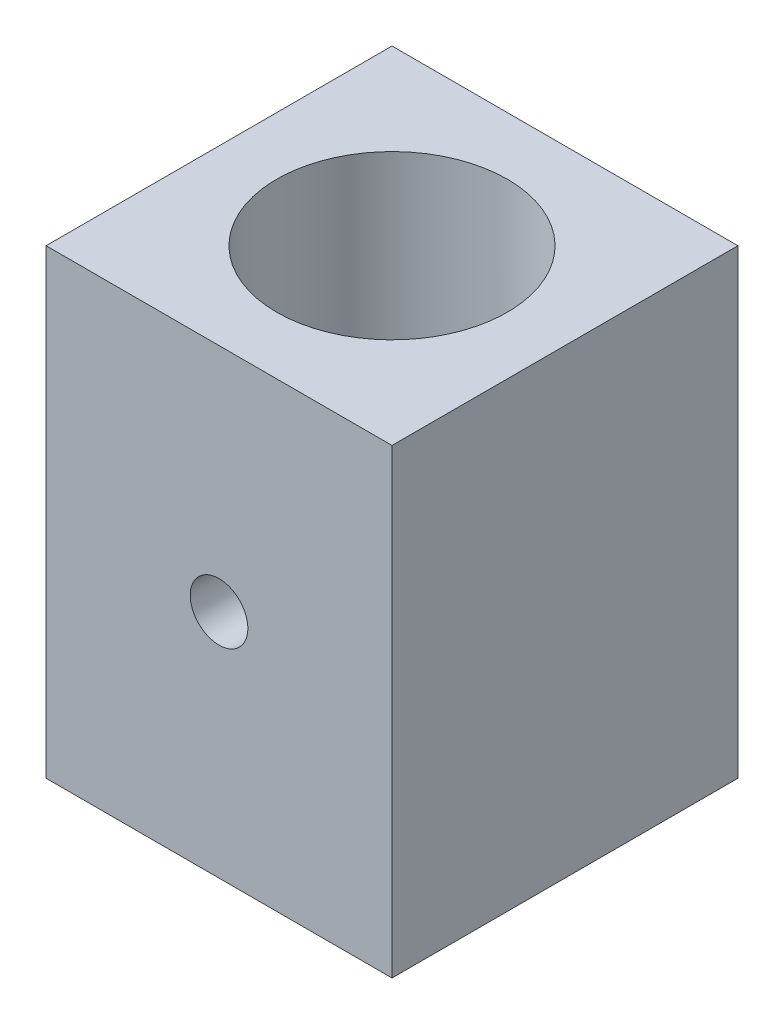
ISO-10303-21;
HEADER;
FILE_DESCRIPTION(('STEP AP214'),'2;1');
FILE_NAME('part.step','',(''),(''),'','','');
FILE_SCHEMA(('AUTOMOTIVE_DESIGN { 1 0 10303 214 1 1 1 1 }'));
ENDSEC;
DATA;
#1=APPLICATION_CONTEXT('core data for automotive mechanical design processes');
#2=APPLICATION_PROTOCOL_DEFINITION('international standard','automotive_design',2000,#1);
#3=PRODUCT_CONTEXT('',#1,'mechanical');
#4=PRODUCT('Part','Part','',(#3));
#5=PRODUCT_RELATED_PRODUCT_CATEGORY('part','',(#4));
#6=PRODUCT_DEFINITION_FORMATION('','',#4);
#7=PRODUCT_DEFINITION_CONTEXT('part definition',#1,'design');
#8=PRODUCT_DEFINITION('design','',#6,#7);
#9=PRODUCT_DEFINITION_SHAPE('','',#8);
#10=(LENGTH_UNIT() NAMED_UNIT(*) SI_UNIT(.MILLI.,.METRE.));
#11=(NAMED_UNIT(*) PLANE_ANGLE_UNIT() SI_UNIT($,.RADIAN.));
#12=(NAMED_UNIT(*) SI_UNIT($,.STERADIAN.) SOLID_ANGLE_UNIT());
#13=UNCERTAINTY_MEASURE_WITH_UNIT(LENGTH_MEASURE(1.E-05),#10,'distance_accuracy_value','');
#14=(GEOMETRIC_REPRESENTATION_CONTEXT(3) GLOBAL_UNCERTAINTY_ASSIGNED_CONTEXT((#13)) GLOBAL_UNIT_ASSIGNED_CONTEXT((#10,
#11,#12)) REPRESENTATION_CONTEXT('',''));
#15=CARTESIAN_POINT('',(0.,0.,0.));
#16=DIRECTION('',(0.,0.,1.));
#17=DIRECTION('',(1.,0.,0.));
#18=AXIS2_PLACEMENT_3D('',#15,#16,#17);
#19=CARTESIAN_POINT('',(0.,101.6,0.));
#20=DIRECTION('',(1.,0.,0.));
#21=DIRECTION('',(0.,0.,-1.));
#22=AXIS2_PLACEMENT_3D('',#19,#20,#21);
#23=PLANE('',#22);
#24=DIRECTION('',(0.,0.,1.));
#25=VECTOR('',#24,1.);
#26=CARTESIAN_POINT('',(0.,0.,0.));
#27=LINE('',#26,#25);
#28=CARTESIAN_POINT('',(0.,0.,-76.2));
#29=VERTEX_POINT('',#28);
#30=CARTESIAN_POINT('',(0.,0.,0.));
#31=VERTEX_POINT('',#30);
#32=EDGE_CURVE('E103',#29,#31,#27,.T.);
#33=ORIENTED_EDGE('',*,*,#32,.T.);
#34=DIRECTION('',(0.,-1.,0.));
#35=VECTOR('',#34,1.);
#36=CARTESIAN_POINT('',(0.,101.6,0.));
#37=LINE('',#36,#35);
#38=CARTESIAN_POINT('',(0.,101.6,0.));
#39=VERTEX_POINT('',#38);
#40=EDGE_CURVE('E11',#39,#31,#37,.T.);
#41=ORIENTED_EDGE('',*,*,#40,.F.);
#42=DIRECTION('',(0.,0.,1.));
#43=VECTOR('',#42,1.);
#44=CARTESIAN_POINT('',(0.,101.6,0.));
#45=LINE('',#44,#43);
#46=CARTESIAN_POINT('',(0.,101.6,-76.2));
#47=VERTEX_POINT('',#46);
#48=EDGE_CURVE('E90',#47,#39,#45,.T.);
#49=ORIENTED_EDGE('',*,*,#48,.F.);
#50=DIRECTION('',(0.,-1.,0.));
#51=VECTOR('',#50,1.);
#52=CARTESIAN_POINT('',(0.,101.6,-76.2));
#53=LINE('',#52,#51);
#54=EDGE_CURVE('E99',#47,#29,#53,.T.);
#55=ORIENTED_EDGE('',*,*,#54,.T.);
#56=EDGE_LOOP('',(#33,#41,#49,#55));
#57=FACE_BOUND('',#56,.T.);
#58=ADVANCED_FACE('F33',(#57),#23,.F.);
#59=CARTESIAN_POINT('',(0.,101.6,0.));
#60=DIRECTION('',(0.,0.,-1.));
#61=DIRECTION('',(-1.,0.,0.));
#62=AXIS2_PLACEMENT_3D('',#59,#60,#61);
#63=PLANE('',#62);
#64=CARTESIAN_POINT('',(38.1,50.8,0.));
#65=DIRECTION('',(0.,0.,1.));
#66=DIRECTION('',(1.,0.,0.));
#67=AXIS2_PLACEMENT_3D('',#64,#65,#66);
#68=CIRCLE('',#67,6.35);
#69=CARTESIAN_POINT('',(44.45,50.8,0.));
#70=VERTEX_POINT('',#69);
#71=EDGE_CURVE('E106',#70,#70,#68,.T.);
#72=ORIENTED_EDGE('',*,*,#71,.F.);
#73=EDGE_LOOP('',(#72));
#74=FACE_BOUND('',#73,.T.);
#75=DIRECTION('',(1.,0.,0.));
#76=VECTOR('',#75,1.);
#77=CARTESIAN_POINT('',(0.,0.,0.));
#78=LINE('',#77,#76);
#79=CARTESIAN_POINT('',(76.2,0.,0.));
#80=VERTEX_POINT('',#79);
#81=EDGE_CURVE('E94',#31,#80,#78,.T.);
#82=ORIENTED_EDGE('',*,*,#81,.T.);
#83=DIRECTION('',(0.,-1.,0.));
#84=VECTOR('',#83,1.);
#85=CARTESIAN_POINT('',(76.2,101.6,0.));
#86=LINE('',#85,#84);
#87=CARTESIAN_POINT('',(76.2,101.6,0.));
#88=VERTEX_POINT('',#87);
#89=EDGE_CURVE('E46',#88,#80,#86,.T.);
#90=ORIENTED_EDGE('',*,*,#89,.F.);
#91=DIRECTION('',(1.,0.,0.));
#92=VECTOR('',#91,1.);
#93=CARTESIAN_POINT('',(0.,101.6,0.));
#94=LINE('',#93,#92);
#95=EDGE_CURVE('E85',#39,#88,#94,.T.);
#96=ORIENTED_EDGE('',*,*,#95,.F.);
#97=ORIENTED_EDGE('',*,*,#40,.T.);
#98=EDGE_LOOP('',(#82,#90,#96,#97));
#99=FACE_BOUND('',#98,.T.);
#100=ADVANCED_FACE('F93',(#74,#99),#63,.F.);
#101=CARTESIAN_POINT('',(76.2,101.6,0.));
#102=DIRECTION('',(-1.,0.,0.));
#103=DIRECTION('',(0.,0.,1.));
#104=AXIS2_PLACEMENT_3D('',#101,#102,#103);
#105=PLANE('',#104);
#106=DIRECTION('',(0.,0.,-1.));
#107=VECTOR('',#106,1.);
#108=CARTESIAN_POINT('',(76.2,0.,0.));
#109=LINE('',#108,#107);
#110=CARTESIAN_POINT('',(76.2,0.,-76.2));
#111=VERTEX_POINT('',#110);
#112=EDGE_CURVE('E72',#80,#111,#109,.T.);
#113=ORIENTED_EDGE('',*,*,#112,.T.);
#114=DIRECTION('',(0.,-1.,0.));
#115=VECTOR('',#114,1.);
#116=CARTESIAN_POINT('',(76.2,101.6,-76.2));
#117=LINE('',#116,#115);
#118=CARTESIAN_POINT('',(76.2,101.6,-76.2));
#119=VERTEX_POINT('',#118);
#120=EDGE_CURVE('E95',#119,#111,#117,.T.);
#121=ORIENTED_EDGE('',*,*,#120,.F.);
#122=DIRECTION('',(0.,0.,-1.));
#123=VECTOR('',#122,1.);
#124=CARTESIAN_POINT('',(76.2,101.6,0.));
#125=LINE('',#124,#123);
#126=EDGE_CURVE('E88',#88,#119,#125,.T.);
#127=ORIENTED_EDGE('',*,*,#126,.F.);
#128=ORIENTED_EDGE('',*,*,#89,.T.);
#129=EDGE_LOOP('',(#113,#121,#127,#128));
#130=FACE_BOUND('',#129,.T.);
#131=ADVANCED_FACE('F97',(#130),#105,.F.);
#132=CARTESIAN_POINT('',(0.,101.6,-76.2));
#133=DIRECTION('',(0.,0.,1.));
#134=DIRECTION('',(1.,0.,0.));
#135=AXIS2_PLACEMENT_3D('',#132,#133,#134);
#136=PLANE('',#135);
#137=CARTESIAN_POINT('',(38.1,50.8,-76.2));
#138=DIRECTION('',(0.,0.,-1.));
#139=DIRECTION('',(-1.,0.,0.));
#140=AXIS2_PLACEMENT_3D('',#137,#138,#139);
#141=CIRCLE('',#140,6.35);
#142=CARTESIAN_POINT('',(31.75,50.8,-76.2));
#143=VERTEX_POINT('',#142);
#144=EDGE_CURVE('E209',#143,#143,#141,.T.);
#145=ORIENTED_EDGE('',*,*,#144,.F.);
#146=EDGE_LOOP('',(#145));
#147=FACE_BOUND('',#146,.T.);
#148=DIRECTION('',(-1.,0.,0.));
#149=VECTOR('',#148,1.);
#150=CARTESIAN_POINT('',(0.,0.,-76.2));
#151=LINE('',#150,#149);
#152=EDGE_CURVE('E78',#111,#29,#151,.T.);
#153=ORIENTED_EDGE('',*,*,#152,.T.);
#154=ORIENTED_EDGE('',*,*,#54,.F.);
#155=DIRECTION('',(-1.,0.,0.));
#156=VECTOR('',#155,1.);
#157=CARTESIAN_POINT('',(0.,101.6,-76.2));
#158=LINE('',#157,#156);
#159=EDGE_CURVE('E55',#119,#47,#158,.T.);
#160=ORIENTED_EDGE('',*,*,#159,.F.);
#161=ORIENTED_EDGE('',*,*,#120,.T.);
#162=EDGE_LOOP('',(#153,#154,#160,#161));
#163=FACE_BOUND('',#162,.T.);
#164=ADVANCED_FACE('F148',(#147,#163),#136,.F.);
#165=CARTESIAN_POINT('',(0.,101.6,0.));
#166=DIRECTION('',(0.,-1.,0.));
#167=DIRECTION('',(0.,0.,-1.));
#168=AXIS2_PLACEMENT_3D('',#165,#166,#167);
#169=PLANE('',#168);
#170=CARTESIAN_POINT('',(38.1,101.6,-38.1));
#171=DIRECTION('',(0.,1.,0.));
#172=DIRECTION('',(0.,0.,1.));
#173=AXIS2_PLACEMENT_3D('',#170,#171,#172);
#174=CIRCLE('',#173,25.4);
#175=CARTESIAN_POINT('',(38.1,101.6,-12.7));
#176=VERTEX_POINT('',#175);
#177=EDGE_CURVE('E115',#176,#176,#174,.T.);
#178=ORIENTED_EDGE('',*,*,#177,.F.);
#179=EDGE_LOOP('',(#178));
#180=FACE_BOUND('',#179,.T.);
#181=ORIENTED_EDGE('',*,*,#48,.T.);
#182=ORIENTED_EDGE('',*,*,#95,.T.);
#183=ORIENTED_EDGE('',*,*,#126,.T.);
#184=ORIENTED_EDGE('',*,*,#159,.T.);
#185=EDGE_LOOP('',(#181,#182,#183,#184));
#186=FACE_BOUND('',#185,.T.);
#187=ADVANCED_FACE('F86',(#180,#186),#169,.F.);
#188=CARTESIAN_POINT('',(0.,0.,0.));
#189=DIRECTION('',(0.,-1.,0.));
#190=DIRECTION('',(0.,0.,-1.));
#191=AXIS2_PLACEMENT_3D('',#188,#189,#190);
#192=PLANE('',#191);
#193=CARTESIAN_POINT('',(38.1,0.,-38.1));
#194=DIRECTION('',(0.,-1.,0.));
#195=DIRECTION('',(0.,0.,-1.));
#196=AXIS2_PLACEMENT_3D('',#193,#194,#195);
#197=CIRCLE('',#196,25.4);
#198=CARTESIAN_POINT('',(38.1,0.,-63.5));
#199=VERTEX_POINT('',#198);
#200=EDGE_CURVE('E215',#199,#199,#197,.T.);
#201=ORIENTED_EDGE('',*,*,#200,.F.);
#202=EDGE_LOOP('',(#201));
#203=FACE_BOUND('',#202,.T.);
#204=ORIENTED_EDGE('',*,*,#32,.F.);
#205=ORIENTED_EDGE('',*,*,#152,.F.);
#206=ORIENTED_EDGE('',*,*,#112,.F.);
#207=ORIENTED_EDGE('',*,*,#81,.F.);
#208=EDGE_LOOP('',(#204,#205,#206,#207));
#209=FACE_BOUND('',#208,.T.);
#210=ADVANCED_FACE('F130',(#203,#209),#192,.T.);
#211=CARTESIAN_POINT('',(38.1,50.8,-73.914));
#212=DIRECTION('',(0.,0.,1.));
#213=DIRECTION('',(1.,0.,0.));
#214=AXIS2_PLACEMENT_3D('',#211,#212,#213);
#215=CYLINDRICAL_SURFACE('',#214,6.35);
#216=CARTESIAN_POINT('',(44.45,50.8,-13.5065557515829));
#217=CARTESIAN_POINT('',(44.4500052855648,50.6246190521291,-13.5065593118815));
#218=CARTESIAN_POINT('',(44.4427330952477,50.4492954961492,-13.5046765956824));
#219=CARTESIAN_POINT('',(44.4137184926536,50.0998794958991,-13.4972113143957));
#220=CARTESIAN_POINT('',(44.3919744212459,49.9257871950992,-13.4916283250901));
#221=CARTESIAN_POINT('',(44.334185289835,49.5800965468169,-13.4769251911211));
#222=CARTESIAN_POINT('',(44.2981356164968,49.4084990223847,-13.4678039054334));
#223=CARTESIAN_POINT('',(44.2120220775296,49.0689991680812,-13.4462952957293));
#224=CARTESIAN_POINT('',(44.1619530274544,48.9010982300524,-13.4339067635651));
#225=CARTESIAN_POINT('',(44.0483049083985,48.5704996099567,-13.4062542543434));
#226=CARTESIAN_POINT('',(43.984748777025,48.4077936265804,-13.3909951642101));
#227=CARTESIAN_POINT('',(43.8445376552918,48.0883159866958,-13.3580220641926));
#228=CARTESIAN_POINT('',(43.7678778244934,47.9315465493512,-13.3403071475974));
#229=CARTESIAN_POINT('',(43.6020648762649,47.6250785603035,-13.3029336758364));
#230=CARTESIAN_POINT('',(43.5129162060305,47.4753775168518,-13.2832758132719));
#231=CARTESIAN_POINT('',(43.3226899389571,47.1838817493515,-13.2425469723113));
#232=CARTESIAN_POINT('',(43.2216078561868,47.0420900282063,-13.2214754637999));
#233=CARTESIAN_POINT('',(43.0061341439591,46.7646820246195,-13.1780788080836));
#234=CARTESIAN_POINT('',(42.8915215774486,46.6292398763758,-13.1557372348684));
#235=CARTESIAN_POINT('',(42.6513489560064,46.3683900897365,-13.1107993343244));
#236=CARTESIAN_POINT('',(42.5257848532596,46.2429861947201,-13.0882029155115));
#237=CARTESIAN_POINT('',(42.2646030446335,46.0031250008121,-13.0433915197414));
#238=CARTESIAN_POINT('',(42.1289880695863,45.8886647477369,-13.0211764411792));
#239=CARTESIAN_POINT('',(41.8485044556239,45.6713845539487,-12.9777218774698));
#240=CARTESIAN_POINT('',(41.703632426396,45.5685689166365,-12.9564827547101));
#241=CARTESIAN_POINT('',(41.4035647958776,45.3740096077564,-12.9152882807928));
#242=CARTESIAN_POINT('',(41.2482542331334,45.2824384978222,-12.8953547157772));
#243=CARTESIAN_POINT('',(40.930200694291,45.1127376891602,-12.8576624539043));
#244=CARTESIAN_POINT('',(40.7674577248759,45.0346079783461,-12.8399037550915));
#245=CARTESIAN_POINT('',(40.4356977709601,44.8924131779268,-12.8070702710075));
#246=CARTESIAN_POINT('',(40.2666815360684,44.8283464141881,-12.7919951663064));
#247=CARTESIAN_POINT('',(39.9235734190764,44.7147939037494,-12.7649612305185));
#248=CARTESIAN_POINT('',(39.7494815372204,44.6653081563472,-12.7530023992817));
#249=CARTESIAN_POINT('',(39.4011142510359,44.5822022882493,-12.7327589928534));
#250=CARTESIAN_POINT('',(39.2269153502031,44.5482785151811,-12.7244043044157));
#251=CARTESIAN_POINT('',(38.8760980457003,44.4951080870203,-12.7112525005553));
#252=CARTESIAN_POINT('',(38.6994788301471,44.4758664860744,-12.7064566102183));
#253=CARTESIAN_POINT('',(38.3452629514341,44.4522586981173,-12.7005673856027));
#254=CARTESIAN_POINT('',(38.1676668164422,44.4478851388882,-12.6994722163483));
#255=CARTESIAN_POINT('',(37.812729552218,44.4540136531898,-12.7010024480947));
#256=CARTESIAN_POINT('',(37.6353885401068,44.4645211717505,-12.7036292109615));
#257=CARTESIAN_POINT('',(37.1137250157236,44.5175026910954,-12.7168203384947));
#258=CARTESIAN_POINT('',(36.7714067973183,44.5809029548842,-12.7325648715246));
#259=CARTESIAN_POINT('',(36.102625359516,44.762346336639,-12.7764306211725));
#260=CARTESIAN_POINT('',(35.776162985143,44.8803923633826,-12.8045524966286));
#261=CARTESIAN_POINT('',(35.1446828466429,45.168826716697,-12.8704978322296));
#262=CARTESIAN_POINT('',(34.8398854971246,45.3396783436341,-12.9084066549504));
#263=CARTESIAN_POINT('',(34.2628456632763,45.7285233747533,-12.9898162880031));
#264=CARTESIAN_POINT('',(33.9906088555677,45.9465249805356,-13.0333180706794));
#265=CARTESIAN_POINT('',(33.4786360292067,46.4304602186119,-13.1225617135422));
#266=CARTESIAN_POINT('',(33.2399790465063,46.6975314302704,-13.1683323357889));
#267=CARTESIAN_POINT('',(32.8105997039866,47.268383929085,-13.2558778829279));
#268=CARTESIAN_POINT('',(32.61987958459,47.5721669310559,-13.2976526210082));
#269=CARTESIAN_POINT('',(32.2910954636198,48.2099366876026,-13.3725793841953));
#270=CARTESIAN_POINT('',(32.1532912705567,48.5440627547005,-13.4056886164151));
#271=CARTESIAN_POINT('',(31.9361462882696,49.2317670889514,-13.4589865412525));
#272=CARTESIAN_POINT('',(31.8567929882668,49.5853411760453,-13.4791779986577));
#273=CARTESIAN_POINT('',(31.7605927179081,50.2918971323907,-13.5037739573488));
#274=CARTESIAN_POINT('',(31.7421501771016,50.6446479892396,-13.5085813407182));
#275=CARTESIAN_POINT('',(31.7639268632336,51.3481877247726,-13.5029614778046));
#276=CARTESIAN_POINT('',(31.8041406901459,51.6989767810796,-13.4925356339239));
#277=CARTESIAN_POINT('',(31.9406892461671,52.3827102114395,-13.4580101205231));
#278=CARTESIAN_POINT('',(32.036094985834,52.7158526457271,-13.4341369668013));
#279=CARTESIAN_POINT('',(32.2792903533202,53.3614159827155,-13.3756217451618));
#280=CARTESIAN_POINT('',(32.4270861864819,53.673834425558,-13.3409784016292));
#281=CARTESIAN_POINT('',(32.774201435217,54.2758405423884,-13.2639781594886));
#282=CARTESIAN_POINT('',(32.9744747223369,54.5648601111601,-13.2214832744737));
#283=CARTESIAN_POINT('',(33.4196711634484,55.1057795842527,-13.1339059328702));
#284=CARTESIAN_POINT('',(33.664601655062,55.3576733761216,-13.0888230518833));
#285=CARTESIAN_POINT('',(34.1994163186743,55.8236356735134,-12.9997865644936));
#286=CARTESIAN_POINT('',(34.4902719457769,56.0366000421281,-12.9558894386465));
#287=CARTESIAN_POINT('',(35.1047461175022,56.4107136179403,-12.8753284271125));
#288=CARTESIAN_POINT('',(35.4283629520394,56.5718655278377,-12.8386641641752));
#289=CARTESIAN_POINT('',(35.9298843869759,56.7703673019524,-12.7923176021324));
#290=CARTESIAN_POINT('',(36.0991836107566,56.8292123089634,-12.7783409014316));
#291=CARTESIAN_POINT('',(36.4423471856015,56.9324324453174,-12.7535665436712));
#292=CARTESIAN_POINT('',(36.616209787495,56.9768130339065,-12.7427676873605));
#293=CARTESIAN_POINT('',(36.9672383959147,57.0507231898603,-12.7246623342743));
#294=CARTESIAN_POINT('',(37.1444045292742,57.0802521858012,-12.717355971875));
#295=CARTESIAN_POINT('',(37.500711745473,57.1242048275591,-12.7064455035998));
#296=CARTESIAN_POINT('',(37.6798527393731,57.1386291508398,-12.7028412316806));
#297=CARTESIAN_POINT('',(38.0338888180725,57.1520594091244,-12.6994858299303));
#298=CARTESIAN_POINT('',(38.2087676703534,57.1514718745455,-12.6996331055302));
#299=CARTESIAN_POINT('',(38.5578385154024,57.135882358325,-12.7035268605624));
#300=CARTESIAN_POINT('',(38.7320305236079,57.1208807025265,-12.7072732586336));
#301=CARTESIAN_POINT('',(39.0785004516009,57.0765868992975,-12.718262785714));
#302=CARTESIAN_POINT('',(39.2507780884666,57.0472926675793,-12.7255064247245));
#303=CARTESIAN_POINT('',(39.5921102365417,56.9746693877932,-12.7432887669523));
#304=CARTESIAN_POINT('',(39.7611658661829,56.9313453073451,-12.7538263038365));
#305=CARTESIAN_POINT('',(40.0940959485992,56.8312638631586,-12.7778496489963));
#306=CARTESIAN_POINT('',(40.2579923139664,56.7745756781337,-12.7913202478473));
#307=CARTESIAN_POINT('',(40.5803411158439,56.6481085770185,-12.8208762517504));
#308=CARTESIAN_POINT('',(40.7387954257971,56.578334220422,-12.8369607458073));
#309=CARTESIAN_POINT('',(41.0493579471698,56.4261623439551,-12.8713315992308));
#310=CARTESIAN_POINT('',(41.2014633316353,56.343759275666,-12.8896189256513));
#311=CARTESIAN_POINT('',(41.4982393480107,56.1669632063038,-12.9279053007575));
#312=CARTESIAN_POINT('',(41.6429124098503,56.0725741594294,-12.9479037842225));
#313=CARTESIAN_POINT('',(41.9274011378101,55.8699833473246,-12.9896003541174));
#314=CARTESIAN_POINT('',(42.0670130527473,55.7615014450962,-13.0113279496347));
#315=CARTESIAN_POINT('',(42.3366027229912,55.5333780387789,-13.0554426690049));
#316=CARTESIAN_POINT('',(42.4665837370908,55.4137403406916,-13.0778295661547));
#317=CARTESIAN_POINT('',(42.7162019523337,55.1639854998922,-13.1226748237058));
#318=CARTESIAN_POINT('',(42.8358328545649,55.0338620674719,-13.14513321912));
#319=CARTESIAN_POINT('',(43.0638352047154,54.7640913078098,-13.1894836023649));
#320=CARTESIAN_POINT('',(43.1722107137363,54.6244474460068,-13.2113757923344));
#321=CARTESIAN_POINT('',(43.378976307988,54.3337410880359,-13.2544012681354));
#322=CARTESIAN_POINT('',(43.4771364364669,54.1825115692983,-13.2755121064312));
#323=CARTESIAN_POINT('',(43.6603041152196,53.8721297205423,-13.3158959544671));
#324=CARTESIAN_POINT('',(43.7453164989198,53.7129803306345,-13.3351696385847));
#325=CARTESIAN_POINT('',(43.9015493433159,53.3878616417949,-13.3713028817327));
#326=CARTESIAN_POINT('',(43.9727758733809,53.2218953832537,-13.3881635022842));
#327=CARTESIAN_POINT('',(44.1008953276159,52.8843150205937,-13.4189632039035));
#328=CARTESIAN_POINT('',(44.1577904370196,52.7127017820352,-13.4329027303208));
#329=CARTESIAN_POINT('',(44.2875257546441,52.25697875345,-13.4650350101791));
#330=CARTESIAN_POINT('',(44.3483466081885,51.9691532478851,-13.4804980964706));
#331=CARTESIAN_POINT('',(44.4295775820771,51.3874978465126,-13.501255052657));
#332=CARTESIAN_POINT('',(44.4499911495307,51.0936684650512,-13.5065497900036));
#333=CARTESIAN_POINT('',(44.45,50.8,-13.5065557515829));
#334=B_SPLINE_CURVE_WITH_KNOTS('',3,(#216,#217,#218,#219,#220,#221,#222,#223,#224,#225,#226,
#227,#228,#229,#230,#231,#232,#233,#234,#235,#236,#237,#238,#239,#240,#241,#242,#243,#244,#245,
#246,#247,#248,#249,#250,#251,#252,#253,#254,#255,#256,#257,#258,#259,#260,#261,#262,#263,#264,
#265,#266,#267,#268,#269,#270,#271,#272,#273,#274,#275,#276,#277,#278,#279,#280,#281,#282,#283,
#284,#285,#286,#287,#288,#289,#290,#291,#292,#293,#294,#295,#296,#297,#298,#299,#300,#301,#302,
#303,#304,#305,#306,#307,#308,#309,#310,#311,#312,#313,#314,#315,#316,#317,#318,#319,#320,#321,
#322,#323,#324,#325,#326,#327,#328,#329,#330,#331,#332,#333),.UNSPECIFIED.,.T.,.F.,(4,2,2,2,2,2,
2,2,2,2,2,2,2,2,2,2,2,2,2,2,2,2,2,2,2,2,2,2,2,2,2,2,2,2,2,2,2,2,2,2,2,2,2,2,2,2,2,2,2,2,2,2,2,2,
2,2,2,2,4),(0.,0.525883394114353,1.05182708859082,1.577940529772,2.1042487882799,
2.62966902200645,3.15528376434758,3.68071181216897,4.20633800822294,4.74220479035221,
5.27827048128822,5.8141910528538,6.35030903814495,6.8938327083873,7.43735588990933,
7.9808143321977,8.5242727483131,9.05662154775777,9.58915351877735,10.1214213988735,
10.6538840876736,11.6940169838559,12.7342052523662,13.7837921176196,14.8335617024671,
15.9117429624832,16.9899746040317,18.0734344846001,19.1566623949116,20.2112799106319,
21.2658003422153,22.3030671989806,23.3404569558507,24.3981973965693,25.4561117914268,
26.5404965182658,27.6248246710234,28.1636112333749,28.7021942076002,29.2407979025403,
29.7793774393931,30.3033877622349,30.8273862396688,31.3514611547069,31.8753507104002,
32.396585719853,32.9176394564633,33.4389227775759,33.9600345708791,34.4938220216419,
35.0274280228546,35.5613565167156,36.0950916875522,36.639009813035,37.1827275034073,
37.7262052690346,38.2696001157562,39.1502462033482,40.0308171605719),.UNSPECIFIED.);
#335=CARTESIAN_POINT('',(44.45,50.8,-13.5065557515829));
#336=VERTEX_POINT('',#335);
#337=EDGE_CURVE('E111',#336,#336,#334,.T.);
#338=ORIENTED_EDGE('',*,*,#337,.T.);
#339=EDGE_LOOP('',(#338));
#340=FACE_BOUND('',#339,.T.);
#341=ORIENTED_EDGE('',*,*,#71,.T.);
#342=EDGE_LOOP('',(#341));
#343=FACE_BOUND('',#342,.T.);
#344=ADVANCED_FACE('F116',(#340,#343),#215,.F.);
#345=CARTESIAN_POINT('',(38.1,-11.938,-38.1));
#346=DIRECTION('',(0.,1.,0.));
#347=DIRECTION('',(0.,0.,1.));
#348=AXIS2_PLACEMENT_3D('',#345,#346,#347);
#349=CYLINDRICAL_SURFACE('',#348,25.4);
#350=ORIENTED_EDGE('',*,*,#200,.T.);
#351=EDGE_LOOP('',(#350));
#352=FACE_BOUND('',#351,.T.);
#353=ORIENTED_EDGE('',*,*,#337,.F.);
#354=EDGE_LOOP('',(#353));
#355=FACE_BOUND('',#354,.T.);
#356=ORIENTED_EDGE('',*,*,#177,.T.);
#357=EDGE_LOOP('',(#356));
#358=FACE_BOUND('',#357,.T.);
#359=CARTESIAN_POINT('',(44.45,50.8,-62.6934442484171));
#360=CARTESIAN_POINT('',(44.4500052855648,50.9753809478709,-62.6934406881185));
#361=CARTESIAN_POINT('',(44.4427330952477,51.1507045038508,-62.6953234043176));
#362=CARTESIAN_POINT('',(44.4137184926536,51.5001205041009,-62.7027886856043));
#363=CARTESIAN_POINT('',(44.3919744212459,51.6742128049008,-62.7083716749099));
#364=CARTESIAN_POINT('',(44.334185289835,52.0199034531831,-62.7230748088789));
#365=CARTESIAN_POINT('',(44.2981356164968,52.1915009776153,-62.7321960945666));
#366=CARTESIAN_POINT('',(44.2120220775296,52.5310008319188,-62.7537047042707));
#367=CARTESIAN_POINT('',(44.1619530274543,52.6989017699476,-62.7660932364349));
#368=CARTESIAN_POINT('',(44.0483049083985,53.0295003900433,-62.7937457456566));
#369=CARTESIAN_POINT('',(43.984748777025,53.1922063734196,-62.8090048357899));
#370=CARTESIAN_POINT('',(43.8445376552918,53.5116840133042,-62.8419779358074));
#371=CARTESIAN_POINT('',(43.7678778244934,53.6684534506488,-62.8596928524026));
#372=CARTESIAN_POINT('',(43.6020648762649,53.9749214396965,-62.8970663241636));
#373=CARTESIAN_POINT('',(43.5129162060305,54.1246224831482,-62.9167241867281));
#374=CARTESIAN_POINT('',(43.3226899389571,54.4161182506485,-62.9574530276887));
#375=CARTESIAN_POINT('',(43.2216078561868,54.5579099717937,-62.9785245362001));
#376=CARTESIAN_POINT('',(43.0061341439591,54.8353179753805,-63.0219211919164));
#377=CARTESIAN_POINT('',(42.8915215774486,54.9707601236242,-63.0442627651316));
#378=CARTESIAN_POINT('',(42.6513489560064,55.2316099102635,-63.0892006656756));
#379=CARTESIAN_POINT('',(42.5257848532596,55.3570138052799,-63.1117970844885));
#380=CARTESIAN_POINT('',(42.2646030446335,55.5968749991879,-63.1566084802586));
#381=CARTESIAN_POINT('',(42.1289880695863,55.7113352522631,-63.1788235588208));
#382=CARTESIAN_POINT('',(41.8485044556239,55.9286154460513,-63.2222781225302));
#383=CARTESIAN_POINT('',(41.703632426396,56.0314310833635,-63.2435172452899));
#384=CARTESIAN_POINT('',(41.4035647958776,56.2259903922436,-63.2847117192072));
#385=CARTESIAN_POINT('',(41.2482542331334,56.3175615021777,-63.3046452842228));
#386=CARTESIAN_POINT('',(40.930200694291,56.4872623108398,-63.3423375460957));
#387=CARTESIAN_POINT('',(40.7674577248759,56.5653920216539,-63.3600962449085));
#388=CARTESIAN_POINT('',(40.4356977709601,56.7075868220732,-63.3929297289925));
#389=CARTESIAN_POINT('',(40.2666815360684,56.7716535858119,-63.4080048336936));
#390=CARTESIAN_POINT('',(39.9235734190764,56.8852060962506,-63.4350387694815));
#391=CARTESIAN_POINT('',(39.7494815372204,56.9346918436528,-63.4469976007183));
#392=CARTESIAN_POINT('',(39.4011142510359,57.0177977117507,-63.4672410071466));
#393=CARTESIAN_POINT('',(39.2269153502031,57.0517214848189,-63.4755956955843));
#394=CARTESIAN_POINT('',(38.8760980457003,57.1048919129797,-63.4887474994446));
#395=CARTESIAN_POINT('',(38.6994788301471,57.1241335139256,-63.4935433897817));
#396=CARTESIAN_POINT('',(38.3452629514341,57.1477413018827,-63.4994326143973));
#397=CARTESIAN_POINT('',(38.1676668164422,57.1521148611118,-63.5005277836517));
#398=CARTESIAN_POINT('',(37.812729552218,57.1459863468102,-63.4989975519054));
#399=CARTESIAN_POINT('',(37.6353885401068,57.1354788282495,-63.4963707890385));
#400=CARTESIAN_POINT('',(37.1137250157236,57.0824973089046,-63.4831796615053));
#401=CARTESIAN_POINT('',(36.7714067973183,57.0190970451158,-63.4674351284754));
#402=CARTESIAN_POINT('',(36.102625359516,56.8376536633609,-63.4235693788276));
#403=CARTESIAN_POINT('',(35.776162985143,56.7196076366174,-63.3954475033714));
#404=CARTESIAN_POINT('',(35.1446828466429,56.4311732833029,-63.3295021677704));
#405=CARTESIAN_POINT('',(34.8398854971246,56.2603216563659,-63.2915933450496));
#406=CARTESIAN_POINT('',(34.2628456632764,55.8714766252467,-63.2101837119969));
#407=CARTESIAN_POINT('',(33.9906088555677,55.6534750194644,-63.1666819293206));
#408=CARTESIAN_POINT('',(33.4786360292067,55.1695397813881,-63.0774382864578));
#409=CARTESIAN_POINT('',(33.2399790465063,54.9024685697296,-63.0316676642111));
#410=CARTESIAN_POINT('',(32.8105997039866,54.331616070915,-62.9441221170721));
#411=CARTESIAN_POINT('',(32.61987958459,54.0278330689441,-62.9023473789918));
#412=CARTESIAN_POINT('',(32.2910954636198,53.3900633123974,-62.8274206158047));
#413=CARTESIAN_POINT('',(32.1532912705567,53.0559372452995,-62.7943113835849));
#414=CARTESIAN_POINT('',(31.9361462882696,52.3682329110486,-62.7410134587475));
#415=CARTESIAN_POINT('',(31.8567929882668,52.0146588239546,-62.7208220013423));
#416=CARTESIAN_POINT('',(31.7605927179081,51.3081028676093,-62.6962260426512));
#417=CARTESIAN_POINT('',(31.7421501771016,50.9553520107604,-62.6914186592818));
#418=CARTESIAN_POINT('',(31.7639268632336,50.2518122752274,-62.6970385221954));
#419=CARTESIAN_POINT('',(31.8041406901459,49.9010232189204,-62.7074643660761));
#420=CARTESIAN_POINT('',(31.9406892461671,49.2172897885605,-62.7419898794769));
#421=CARTESIAN_POINT('',(32.036094985834,48.8841473542729,-62.7658630331987));
#422=CARTESIAN_POINT('',(32.2792903533202,48.2385840172845,-62.8243782548382));
#423=CARTESIAN_POINT('',(32.4270861864819,47.926165574442,-62.8590215983708));
#424=CARTESIAN_POINT('',(32.774201435217,47.3241594576116,-62.9360218405114));
#425=CARTESIAN_POINT('',(32.9744747223369,47.0351398888399,-62.9785167255263));
#426=CARTESIAN_POINT('',(33.4196711634484,46.4942204157473,-63.0660940671299));
#427=CARTESIAN_POINT('',(33.664601655062,46.2423266238784,-63.1111769481167));
#428=CARTESIAN_POINT('',(34.1994163186743,45.7763643264866,-63.2002134355064));
#429=CARTESIAN_POINT('',(34.490271945777,45.5633999578719,-63.2441105613535));
#430=CARTESIAN_POINT('',(35.1047461175022,45.1892863820597,-63.3246715728875));
#431=CARTESIAN_POINT('',(35.4283629520394,45.0281344721623,-63.3613358358248));
#432=CARTESIAN_POINT('',(35.929884386976,44.8296326980476,-63.4076823978676));
#433=CARTESIAN_POINT('',(36.0991836107567,44.7707876910366,-63.4216590985684));
#434=CARTESIAN_POINT('',(36.4423471856016,44.6675675546826,-63.4464334563288));
#435=CARTESIAN_POINT('',(36.6162097874951,44.6231869660935,-63.4572323126395));
#436=CARTESIAN_POINT('',(36.9672383959147,44.5492768101397,-63.4753376657257));
#437=CARTESIAN_POINT('',(37.1444045292742,44.5197478141988,-63.482644028125));
#438=CARTESIAN_POINT('',(37.500711745473,44.4757951724409,-63.4935544964002));
#439=CARTESIAN_POINT('',(37.6798527393731,44.4613708491602,-63.4971587683194));
#440=CARTESIAN_POINT('',(38.0338888180725,44.4479405908756,-63.5005141700697));
#441=CARTESIAN_POINT('',(38.2087676703534,44.4485281254544,-63.5003668944698));
#442=CARTESIAN_POINT('',(38.5578385154024,44.464117641675,-63.4964731394376));
#443=CARTESIAN_POINT('',(38.7320305236079,44.4791192974735,-63.4927267413664));
#444=CARTESIAN_POINT('',(39.0785004516009,44.5234131007024,-63.481737214286));
#445=CARTESIAN_POINT('',(39.2507780884666,44.5527073324207,-63.4744935752755));
#446=CARTESIAN_POINT('',(39.5921102365417,44.6253306122068,-63.4567112330477));
#447=CARTESIAN_POINT('',(39.7611658661829,44.6686546926549,-63.4461736961635));
#448=CARTESIAN_POINT('',(40.0940959485992,44.7687361368414,-63.4221503510037));
#449=CARTESIAN_POINT('',(40.2579923139664,44.8254243218663,-63.4086797521527));
#450=CARTESIAN_POINT('',(40.5803411158439,44.9518914229815,-63.3791237482496));
#451=CARTESIAN_POINT('',(40.7387954257971,45.021665779578,-63.3630392541927));
#452=CARTESIAN_POINT('',(41.0493579471698,45.1738376560448,-63.3286684007692));
#453=CARTESIAN_POINT('',(41.2014633316353,45.256240724334,-63.3103810743487));
#454=CARTESIAN_POINT('',(41.4982393480107,45.4330367936962,-63.2720946992425));
#455=CARTESIAN_POINT('',(41.6429124098503,45.5274258405706,-63.2520962157775));
#456=CARTESIAN_POINT('',(41.9274011378101,45.7300166526754,-63.2103996458826));
#457=CARTESIAN_POINT('',(42.0670130527473,45.8384985549038,-63.1886720503653));
#458=CARTESIAN_POINT('',(42.3366027229912,46.0666219612211,-63.1445573309951));
#459=CARTESIAN_POINT('',(42.4665837370908,46.1862596593084,-63.1221704338453));
#460=CARTESIAN_POINT('',(42.7162019523337,46.4360145001078,-63.0773251762942));
#461=CARTESIAN_POINT('',(42.8358328545649,46.5661379325281,-63.05486678088));
#462=CARTESIAN_POINT('',(43.0638352047154,46.8359086921902,-63.0105163976351));
#463=CARTESIAN_POINT('',(43.1722107137363,46.9755525539932,-62.9886242076656));
#464=CARTESIAN_POINT('',(43.378976307988,47.2662589119641,-62.9455987318646));
#465=CARTESIAN_POINT('',(43.4771364364669,47.4174884307017,-62.9244878935689));
#466=CARTESIAN_POINT('',(43.6603041152196,47.7278702794577,-62.8841040455329));
#467=CARTESIAN_POINT('',(43.7453164989198,47.8870196693655,-62.8648303614153));
#468=CARTESIAN_POINT('',(43.9015493433159,48.2121383582051,-62.8286971182673));
#469=CARTESIAN_POINT('',(43.9727758733809,48.3781046167463,-62.8118364977159));
#470=CARTESIAN_POINT('',(44.1008953276159,48.7156849794063,-62.7810367960966));
#471=CARTESIAN_POINT('',(44.1577904370196,48.8872982179647,-62.7670972696792));
#472=CARTESIAN_POINT('',(44.2875257546441,49.34302124655,-62.7349649898209));
#473=CARTESIAN_POINT('',(44.3483466081885,49.6308467521149,-62.7195019035294));
#474=CARTESIAN_POINT('',(44.4295775820771,50.2125021534874,-62.698744947343));
#475=CARTESIAN_POINT('',(44.4499911495307,50.5063315349488,-62.6934502099964));
#476=CARTESIAN_POINT('',(44.45,50.8,-62.6934442484171));
#477=B_SPLINE_CURVE_WITH_KNOTS('',3,(#359,#360,#361,#362,#363,#364,#365,#366,#367,#368,#369,
#370,#371,#372,#373,#374,#375,#376,#377,#378,#379,#380,#381,#382,#383,#384,#385,#386,#387,#388,
#389,#390,#391,#392,#393,#394,#395,#396,#397,#398,#399,#400,#401,#402,#403,#404,#405,#406,#407,
#408,#409,#410,#411,#412,#413,#414,#415,#416,#417,#418,#419,#420,#421,#422,#423,#424,#425,#426,
#427,#428,#429,#430,#431,#432,#433,#434,#435,#436,#437,#438,#439,#440,#441,#442,#443,#444,#445,
#446,#447,#448,#449,#450,#451,#452,#453,#454,#455,#456,#457,#458,#459,#460,#461,#462,#463,#464,
#465,#466,#467,#468,#469,#470,#471,#472,#473,#474,#475,#476),.UNSPECIFIED.,.T.,.F.,(4,2,2,2,2,2,
2,2,2,2,2,2,2,2,2,2,2,2,2,2,2,2,2,2,2,2,2,2,2,2,2,2,2,2,2,2,2,2,2,2,2,2,2,2,2,2,2,2,2,2,2,2,2,2,
2,2,2,2,4),(0.,0.525883394114353,1.05182708859082,1.57794052977201,2.1042487882799,
2.62966902200645,3.15528376434758,3.68071181216897,4.20633800822294,4.74220479035223,
5.27827048128822,5.8141910528538,6.35030903814495,6.89383270838729,7.43735588990934,
7.98081433219772,8.5242727483131,9.05662154775776,9.58915351877736,10.1214213988735,
10.6538840876736,11.6940169838559,12.7342052523662,13.7837921176196,14.8335617024671,
15.9117429624832,16.9899746040317,18.0734344846001,19.1566623949116,20.2112799106319,
21.2658003422153,22.3030671989806,23.3404569558507,24.3981973965693,25.4561117914268,
26.5404965182658,27.6248246710234,28.1636112333749,28.7021942076002,29.2407979025403,
29.7793774393931,30.3033877622349,30.8273862396688,31.3514611547069,31.8753507104002,
32.396585719853,32.9176394564633,33.4389227775759,33.9600345708791,34.4938220216419,
35.0274280228545,35.5613565167156,36.0950916875522,36.6390098130349,37.1827275034073,
37.7262052690346,38.2696001157562,39.1502462033482,40.0308171605719),.UNSPECIFIED.);
#478=CARTESIAN_POINT('',(44.45,50.8,-62.6934442484171));
#479=VERTEX_POINT('',#478);
#480=EDGE_CURVE('E36',#479,#479,#477,.T.);
#481=ORIENTED_EDGE('',*,*,#480,.F.);
#482=EDGE_LOOP('',(#481));
#483=FACE_BOUND('',#482,.T.);
#484=ADVANCED_FACE('F119',(#352,#355,#358,#483),#349,.F.);
#485=ORIENTED_EDGE('',*,*,#480,.T.);
#486=EDGE_LOOP('',(#485));
#487=FACE_BOUND('',#486,.T.);
#488=ORIENTED_EDGE('',*,*,#144,.T.);
#489=EDGE_LOOP('',(#488));
#490=FACE_BOUND('',#489,.T.);
#491=ADVANCED_FACE('F122',(#487,#490),#215,.F.);
#492=CLOSED_SHELL('',(#58,#100,#131,#164,#187,#210,#344,#484,#491));
#493=MANIFOLD_SOLID_BREP('B2',#492);
#494=ADVANCED_BREP_SHAPE_REPRESENTATION('',(#18,#493),#14);
#495=SHAPE_DEFINITION_REPRESENTATION(#9,#494);
ENDSEC;
END-ISO-10303-21;
